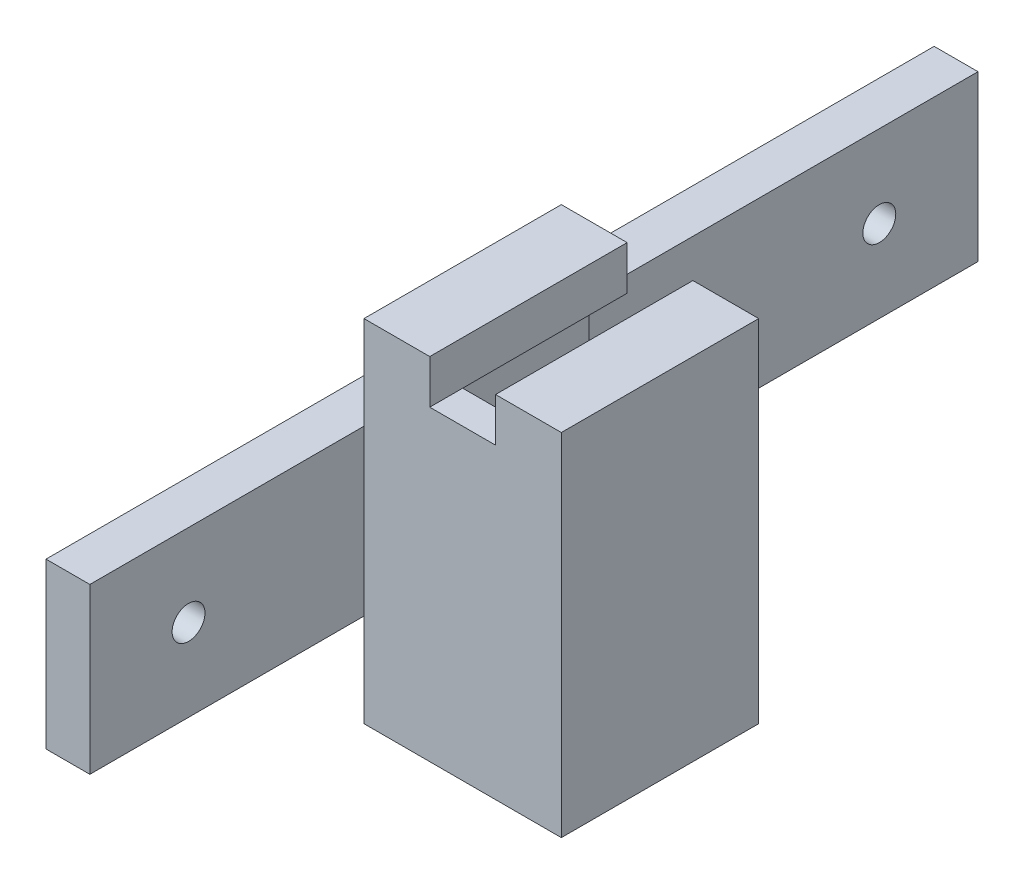
ISO-10303-21;
HEADER;
FILE_DESCRIPTION(('STEP AP214'),'2;1');
FILE_NAME('part.step','',(''),(''),'','','');
FILE_SCHEMA(('AUTOMOTIVE_DESIGN { 1 0 10303 214 1 1 1 1 }'));
ENDSEC;
DATA;
#1=APPLICATION_CONTEXT('core data for automotive mechanical design processes');
#2=APPLICATION_PROTOCOL_DEFINITION('international standard','automotive_design',2000,#1);
#3=PRODUCT_CONTEXT('',#1,'mechanical');
#4=PRODUCT('Part','Part','',(#3));
#5=PRODUCT_RELATED_PRODUCT_CATEGORY('part','',(#4));
#6=PRODUCT_DEFINITION_FORMATION('','',#4);
#7=PRODUCT_DEFINITION_CONTEXT('part definition',#1,'design');
#8=PRODUCT_DEFINITION('design','',#6,#7);
#9=PRODUCT_DEFINITION_SHAPE('','',#8);
#10=(LENGTH_UNIT() NAMED_UNIT(*) SI_UNIT(.MILLI.,.METRE.));
#11=(NAMED_UNIT(*) PLANE_ANGLE_UNIT() SI_UNIT($,.RADIAN.));
#12=(NAMED_UNIT(*) SI_UNIT($,.STERADIAN.) SOLID_ANGLE_UNIT());
#13=UNCERTAINTY_MEASURE_WITH_UNIT(LENGTH_MEASURE(1.E-05),#10,'distance_accuracy_value','');
#14=(GEOMETRIC_REPRESENTATION_CONTEXT(3) GLOBAL_UNCERTAINTY_ASSIGNED_CONTEXT((#13)) GLOBAL_UNIT_ASSIGNED_CONTEXT((#10,
#11,#12)) REPRESENTATION_CONTEXT('',''));
#15=CARTESIAN_POINT('',(0.,0.,0.));
#16=DIRECTION('',(0.,0.,1.));
#17=DIRECTION('',(1.,0.,0.));
#18=AXIS2_PLACEMENT_3D('',#15,#16,#17);
#19=CARTESIAN_POINT('',(-18.,0.,-3.));
#20=DIRECTION('',(1.,0.,0.));
#21=DIRECTION('',(0.,1.,0.));
#22=AXIS2_PLACEMENT_3D('',#19,#20,#21);
#23=PLANE('',#22);
#24=DIRECTION('',(0.,0.,1.));
#25=VECTOR('',#24,1.);
#26=CARTESIAN_POINT('',(-18.,23.5,25.));
#27=LINE('',#26,#25);
#28=CARTESIAN_POINT('',(-18.,23.5,-18.));
#29=VERTEX_POINT('',#28);
#30=CARTESIAN_POINT('',(-18.,23.5,0.));
#31=VERTEX_POINT('',#30);
#32=EDGE_CURVE('E11',#29,#31,#27,.T.);
#33=ORIENTED_EDGE('',*,*,#32,.T.);
#34=DIRECTION('',(0.,-1.,0.));
#35=VECTOR('',#34,1.);
#36=CARTESIAN_POINT('',(-18.,0.,0.));
#37=LINE('',#36,#35);
#38=CARTESIAN_POINT('',(-18.,32.,0.));
#39=VERTEX_POINT('',#38);
#40=EDGE_CURVE('E309',#39,#31,#37,.T.);
#41=ORIENTED_EDGE('',*,*,#40,.F.);
#42=DIRECTION('',(0.,0.,1.));
#43=VECTOR('',#42,1.);
#44=CARTESIAN_POINT('',(-18.,32.,-3.));
#45=LINE('',#44,#43);
#46=CARTESIAN_POINT('',(-18.,32.,-18.));
#47=VERTEX_POINT('',#46);
#48=EDGE_CURVE('E319',#47,#39,#45,.T.);
#49=ORIENTED_EDGE('',*,*,#48,.F.);
#50=DIRECTION('',(0.,-1.,0.));
#51=VECTOR('',#50,1.);
#52=CARTESIAN_POINT('',(-18.,0.,-18.));
#53=LINE('',#52,#51);
#54=EDGE_CURVE('E228',#47,#29,#53,.T.);
#55=ORIENTED_EDGE('',*,*,#54,.T.);
#56=EDGE_LOOP('',(#33,#41,#49,#55));
#57=FACE_BOUND('',#56,.T.);
#58=ADVANCED_FACE('F39',(#57),#23,.F.);
#59=DIRECTION('',(0.,0.,-1.));
#60=VECTOR('',#59,1.);
#61=CARTESIAN_POINT('',(-18.,8.5,25.));
#62=LINE('',#61,#60);
#63=CARTESIAN_POINT('',(-18.,8.5,0.));
#64=VERTEX_POINT('',#63);
#65=CARTESIAN_POINT('',(-18.,8.5,-18.));
#66=VERTEX_POINT('',#65);
#67=EDGE_CURVE('E48',#64,#66,#62,.T.);
#68=ORIENTED_EDGE('',*,*,#67,.T.);
#69=CARTESIAN_POINT('',(-18.,0.,-18.));
#70=VERTEX_POINT('',#69);
#71=EDGE_CURVE('E226',#66,#70,#53,.T.);
#72=ORIENTED_EDGE('',*,*,#71,.T.);
#73=DIRECTION('',(0.,0.,1.));
#74=VECTOR('',#73,1.);
#75=CARTESIAN_POINT('',(-18.,0.,-3.));
#76=LINE('',#75,#74);
#77=CARTESIAN_POINT('',(-18.,0.,0.));
#78=VERTEX_POINT('',#77);
#79=EDGE_CURVE('E316',#70,#78,#76,.T.);
#80=ORIENTED_EDGE('',*,*,#79,.T.);
#81=EDGE_CURVE('E308',#64,#78,#37,.T.);
#82=ORIENTED_EDGE('',*,*,#81,.F.);
#83=EDGE_LOOP('',(#68,#72,#80,#82));
#84=FACE_BOUND('',#83,.T.);
#85=ADVANCED_FACE('F360',(#84),#23,.F.);
#86=CARTESIAN_POINT('',(0.,0.,-3.));
#87=DIRECTION('',(0.,0.,1.));
#88=DIRECTION('',(-1.,0.,0.));
#89=AXIS2_PLACEMENT_3D('',#86,#87,#88);
#90=PLANE('',#89);
#91=DIRECTION('',(1.,0.,0.));
#92=VECTOR('',#91,1.);
#93=CARTESIAN_POINT('',(-15.5,28.,-3.));
#94=LINE('',#93,#92);
#95=CARTESIAN_POINT('',(-15.5,28.,-3.));
#96=VERTEX_POINT('',#95);
#97=CARTESIAN_POINT('',(-12.,28.,-3.));
#98=VERTEX_POINT('',#97);
#99=EDGE_CURVE('E227',#96,#98,#94,.T.);
#100=ORIENTED_EDGE('',*,*,#99,.T.);
#101=DIRECTION('',(-1.,0.,0.));
#102=VECTOR('',#101,1.);
#103=CARTESIAN_POINT('',(-12.,28.,-3.));
#104=LINE('',#103,#102);
#105=CARTESIAN_POINT('',(-6.,28.,-3.));
#106=VERTEX_POINT('',#105);
#107=EDGE_CURVE('E287',#106,#98,#104,.T.);
#108=ORIENTED_EDGE('',*,*,#107,.F.);
#109=DIRECTION('',(1.,0.,0.));
#110=VECTOR('',#109,1.);
#111=CARTESIAN_POINT('',(-6.,28.,-3.));
#112=LINE('',#111,#110);
#113=CARTESIAN_POINT('',(-2.5,28.,-3.));
#114=VERTEX_POINT('',#113);
#115=EDGE_CURVE('E221',#106,#114,#112,.T.);
#116=ORIENTED_EDGE('',*,*,#115,.T.);
#117=DIRECTION('',(0.,-1.,0.));
#118=VECTOR('',#117,1.);
#119=CARTESIAN_POINT('',(-2.5,28.,-3.));
#120=LINE('',#119,#118);
#121=CARTESIAN_POINT('',(-2.5,4.,-3.));
#122=VERTEX_POINT('',#121);
#123=EDGE_CURVE('E263',#114,#122,#120,.T.);
#124=ORIENTED_EDGE('',*,*,#123,.T.);
#125=DIRECTION('',(-1.,0.,0.));
#126=VECTOR('',#125,1.);
#127=CARTESIAN_POINT('',(-2.5,4.,-3.));
#128=LINE('',#127,#126);
#129=CARTESIAN_POINT('',(-15.5,4.,-3.));
#130=VERTEX_POINT('',#129);
#131=EDGE_CURVE('E266',#122,#130,#128,.T.);
#132=ORIENTED_EDGE('',*,*,#131,.T.);
#133=DIRECTION('',(0.,1.,0.));
#134=VECTOR('',#133,1.);
#135=CARTESIAN_POINT('',(-15.5,4.,-3.));
#136=LINE('',#135,#134);
#137=EDGE_CURVE('E269',#130,#96,#136,.T.);
#138=ORIENTED_EDGE('',*,*,#137,.T.);
#139=EDGE_LOOP('',(#100,#108,#116,#124,#132,#138));
#140=FACE_BOUND('',#139,.T.);
#141=ADVANCED_FACE('F393',(#140),#90,.F.);
#142=CARTESIAN_POINT('',(0.,0.,-3.));
#143=DIRECTION('',(-1.,0.,0.));
#144=DIRECTION('',(0.,0.,-1.));
#145=AXIS2_PLACEMENT_3D('',#142,#143,#144);
#146=PLANE('',#145);
#147=DIRECTION('',(0.,1.,0.));
#148=VECTOR('',#147,1.);
#149=CARTESIAN_POINT('',(0.,0.,0.));
#150=LINE('',#149,#148);
#151=CARTESIAN_POINT('',(0.,0.,0.));
#152=VERTEX_POINT('',#151);
#153=CARTESIAN_POINT('',(0.,32.,0.));
#154=VERTEX_POINT('',#153);
#155=EDGE_CURVE('E286',#152,#154,#150,.T.);
#156=ORIENTED_EDGE('',*,*,#155,.F.);
#157=DIRECTION('',(0.,0.,1.));
#158=VECTOR('',#157,1.);
#159=CARTESIAN_POINT('',(0.,0.,-3.));
#160=LINE('',#159,#158);
#161=CARTESIAN_POINT('',(0.,0.,-18.));
#162=VERTEX_POINT('',#161);
#163=EDGE_CURVE('E290',#162,#152,#160,.T.);
#164=ORIENTED_EDGE('',*,*,#163,.F.);
#165=DIRECTION('',(0.,1.,0.));
#166=VECTOR('',#165,1.);
#167=CARTESIAN_POINT('',(0.,32.,-18.));
#168=LINE('',#167,#166);
#169=CARTESIAN_POINT('',(0.,32.,-18.));
#170=VERTEX_POINT('',#169);
#171=EDGE_CURVE('E234',#162,#170,#168,.T.);
#172=ORIENTED_EDGE('',*,*,#171,.T.);
#173=DIRECTION('',(0.,0.,1.));
#174=VECTOR('',#173,1.);
#175=CARTESIAN_POINT('',(0.,32.,-3.));
#176=LINE('',#175,#174);
#177=EDGE_CURVE('E43',#170,#154,#176,.T.);
#178=ORIENTED_EDGE('',*,*,#177,.T.);
#179=EDGE_LOOP('',(#156,#164,#172,#178));
#180=FACE_BOUND('',#179,.T.);
#181=ADVANCED_FACE('F41',(#180),#146,.F.);
#182=CARTESIAN_POINT('',(-6.,32.,-3.));
#183=DIRECTION('',(0.,-1.,0.));
#184=DIRECTION('',(1.,0.,0.));
#185=AXIS2_PLACEMENT_3D('',#182,#183,#184);
#186=PLANE('',#185);
#187=DIRECTION('',(-1.,0.,0.));
#188=VECTOR('',#187,1.);
#189=CARTESIAN_POINT('',(-6.,32.,0.));
#190=LINE('',#189,#188);
#191=CARTESIAN_POINT('',(-6.,32.,0.));
#192=VERTEX_POINT('',#191);
#193=EDGE_CURVE('E294',#154,#192,#190,.T.);
#194=ORIENTED_EDGE('',*,*,#193,.F.);
#195=ORIENTED_EDGE('',*,*,#177,.F.);
#196=DIRECTION('',(-1.,0.,0.));
#197=VECTOR('',#196,1.);
#198=CARTESIAN_POINT('',(-6.,32.,-18.));
#199=LINE('',#198,#197);
#200=CARTESIAN_POINT('',(-6.,32.,-18.));
#201=VERTEX_POINT('',#200);
#202=EDGE_CURVE('E237',#170,#201,#199,.T.);
#203=ORIENTED_EDGE('',*,*,#202,.T.);
#204=DIRECTION('',(0.,0.,1.));
#205=VECTOR('',#204,1.);
#206=CARTESIAN_POINT('',(-6.,32.,-3.));
#207=LINE('',#206,#205);
#208=EDGE_CURVE('E330',#201,#192,#207,.T.);
#209=ORIENTED_EDGE('',*,*,#208,.T.);
#210=EDGE_LOOP('',(#194,#195,#203,#209));
#211=FACE_BOUND('',#210,.T.);
#212=ADVANCED_FACE('F411',(#211),#186,.F.);
#213=CARTESIAN_POINT('',(-6.,28.,-3.));
#214=DIRECTION('',(1.,0.,0.));
#215=DIRECTION('',(0.,1.,0.));
#216=AXIS2_PLACEMENT_3D('',#213,#214,#215);
#217=PLANE('',#216);
#218=DIRECTION('',(0.,-1.,0.));
#219=VECTOR('',#218,1.);
#220=CARTESIAN_POINT('',(-6.,28.,0.));
#221=LINE('',#220,#219);
#222=CARTESIAN_POINT('',(-6.,28.,0.));
#223=VERTEX_POINT('',#222);
#224=EDGE_CURVE('E297',#192,#223,#221,.T.);
#225=ORIENTED_EDGE('',*,*,#224,.F.);
#226=ORIENTED_EDGE('',*,*,#208,.F.);
#227=DIRECTION('',(0.,-1.,0.));
#228=VECTOR('',#227,1.);
#229=CARTESIAN_POINT('',(-6.,28.,-18.));
#230=LINE('',#229,#228);
#231=CARTESIAN_POINT('',(-6.,28.,-18.));
#232=VERTEX_POINT('',#231);
#233=EDGE_CURVE('E240',#201,#232,#230,.T.);
#234=ORIENTED_EDGE('',*,*,#233,.T.);
#235=DIRECTION('',(0.,0.,1.));
#236=VECTOR('',#235,1.);
#237=CARTESIAN_POINT('',(-6.,28.,-18.));
#238=LINE('',#237,#236);
#239=EDGE_CURVE('E283',#232,#106,#238,.T.);
#240=ORIENTED_EDGE('',*,*,#239,.T.);
#241=DIRECTION('',(0.,0.,1.));
#242=VECTOR('',#241,1.);
#243=CARTESIAN_POINT('',(-6.,28.,-3.));
#244=LINE('',#243,#242);
#245=EDGE_CURVE('E328',#106,#223,#244,.T.);
#246=ORIENTED_EDGE('',*,*,#245,.T.);
#247=EDGE_LOOP('',(#225,#226,#234,#240,#246));
#248=FACE_BOUND('',#247,.T.);
#249=ADVANCED_FACE('F408',(#248),#217,.F.);
#250=CARTESIAN_POINT('',(-12.,28.,-3.));
#251=DIRECTION('',(0.,-1.,0.));
#252=DIRECTION('',(0.,0.,1.));
#253=AXIS2_PLACEMENT_3D('',#250,#251,#252);
#254=PLANE('',#253);
#255=DIRECTION('',(-1.,0.,0.));
#256=VECTOR('',#255,1.);
#257=CARTESIAN_POINT('',(-12.,28.,0.));
#258=LINE('',#257,#256);
#259=CARTESIAN_POINT('',(-12.,28.,0.));
#260=VERTEX_POINT('',#259);
#261=EDGE_CURVE('E300',#223,#260,#258,.T.);
#262=ORIENTED_EDGE('',*,*,#261,.F.);
#263=ORIENTED_EDGE('',*,*,#245,.F.);
#264=ORIENTED_EDGE('',*,*,#107,.T.);
#265=DIRECTION('',(0.,0.,1.));
#266=VECTOR('',#265,1.);
#267=CARTESIAN_POINT('',(-12.,28.,-3.));
#268=LINE('',#267,#266);
#269=EDGE_CURVE('E325',#98,#260,#268,.T.);
#270=ORIENTED_EDGE('',*,*,#269,.T.);
#271=EDGE_LOOP('',(#262,#263,#264,#270));
#272=FACE_BOUND('',#271,.T.);
#273=ADVANCED_FACE('F404',(#272),#254,.F.);
#274=CARTESIAN_POINT('',(-12.,32.,-3.));
#275=DIRECTION('',(-1.,0.,0.));
#276=DIRECTION('',(0.,0.,-1.));
#277=AXIS2_PLACEMENT_3D('',#274,#275,#276);
#278=PLANE('',#277);
#279=DIRECTION('',(0.,1.,0.));
#280=VECTOR('',#279,1.);
#281=CARTESIAN_POINT('',(-12.,32.,0.));
#282=LINE('',#281,#280);
#283=CARTESIAN_POINT('',(-12.,32.,0.));
#284=VERTEX_POINT('',#283);
#285=EDGE_CURVE('E303',#260,#284,#282,.T.);
#286=ORIENTED_EDGE('',*,*,#285,.F.);
#287=ORIENTED_EDGE('',*,*,#269,.F.);
#288=DIRECTION('',(0.,0.,1.));
#289=VECTOR('',#288,1.);
#290=CARTESIAN_POINT('',(-12.,28.,-18.));
#291=LINE('',#290,#289);
#292=CARTESIAN_POINT('',(-12.,28.,-18.));
#293=VERTEX_POINT('',#292);
#294=EDGE_CURVE('E260',#293,#98,#291,.T.);
#295=ORIENTED_EDGE('',*,*,#294,.F.);
#296=DIRECTION('',(0.,1.,0.));
#297=VECTOR('',#296,1.);
#298=CARTESIAN_POINT('',(-12.,32.,-18.));
#299=LINE('',#298,#297);
#300=CARTESIAN_POINT('',(-12.,32.,-18.));
#301=VERTEX_POINT('',#300);
#302=EDGE_CURVE('E257',#293,#301,#299,.T.);
#303=ORIENTED_EDGE('',*,*,#302,.T.);
#304=DIRECTION('',(0.,0.,1.));
#305=VECTOR('',#304,1.);
#306=CARTESIAN_POINT('',(-12.,32.,-3.));
#307=LINE('',#306,#305);
#308=EDGE_CURVE('E322',#301,#284,#307,.T.);
#309=ORIENTED_EDGE('',*,*,#308,.T.);
#310=EDGE_LOOP('',(#286,#287,#295,#303,#309));
#311=FACE_BOUND('',#310,.T.);
#312=ADVANCED_FACE('F400',(#311),#278,.F.);
#313=CARTESIAN_POINT('',(-12.,32.,-3.));
#314=DIRECTION('',(0.,-1.,0.));
#315=DIRECTION('',(0.,0.,1.));
#316=AXIS2_PLACEMENT_3D('',#313,#314,#315);
#317=PLANE('',#316);
#318=DIRECTION('',(-1.,0.,0.));
#319=VECTOR('',#318,1.);
#320=CARTESIAN_POINT('',(-12.,32.,0.));
#321=LINE('',#320,#319);
#322=EDGE_CURVE('E306',#284,#39,#321,.T.);
#323=ORIENTED_EDGE('',*,*,#322,.F.);
#324=ORIENTED_EDGE('',*,*,#308,.F.);
#325=DIRECTION('',(-1.,0.,0.));
#326=VECTOR('',#325,1.);
#327=CARTESIAN_POINT('',(-18.,32.,-18.));
#328=LINE('',#327,#326);
#329=EDGE_CURVE('E224',#301,#47,#328,.T.);
#330=ORIENTED_EDGE('',*,*,#329,.T.);
#331=ORIENTED_EDGE('',*,*,#48,.T.);
#332=EDGE_LOOP('',(#323,#324,#330,#331));
#333=FACE_BOUND('',#332,.T.);
#334=ADVANCED_FACE('F397',(#333),#317,.F.);
#335=CARTESIAN_POINT('',(0.,0.,-3.));
#336=DIRECTION('',(0.,1.,0.));
#337=DIRECTION('',(-1.,0.,0.));
#338=AXIS2_PLACEMENT_3D('',#335,#336,#337);
#339=PLANE('',#338);
#340=DIRECTION('',(1.,0.,0.));
#341=VECTOR('',#340,1.);
#342=CARTESIAN_POINT('',(0.,0.,0.));
#343=LINE('',#342,#341);
#344=EDGE_CURVE('E291',#78,#152,#343,.T.);
#345=ORIENTED_EDGE('',*,*,#344,.F.);
#346=ORIENTED_EDGE('',*,*,#79,.F.);
#347=DIRECTION('',(1.,0.,0.));
#348=VECTOR('',#347,1.);
#349=CARTESIAN_POINT('',(-18.,0.,-18.));
#350=LINE('',#349,#348);
#351=EDGE_CURVE('E231',#70,#162,#350,.T.);
#352=ORIENTED_EDGE('',*,*,#351,.T.);
#353=ORIENTED_EDGE('',*,*,#163,.T.);
#354=EDGE_LOOP('',(#345,#346,#352,#353));
#355=FACE_BOUND('',#354,.T.);
#356=ADVANCED_FACE('F364',(#355),#339,.F.);
#357=CARTESIAN_POINT('',(0.,0.,0.));
#358=DIRECTION('',(0.,0.,1.));
#359=DIRECTION('',(-1.,0.,0.));
#360=AXIS2_PLACEMENT_3D('',#357,#358,#359);
#361=PLANE('',#360);
#362=ORIENTED_EDGE('',*,*,#155,.T.);
#363=ORIENTED_EDGE('',*,*,#193,.T.);
#364=ORIENTED_EDGE('',*,*,#224,.T.);
#365=ORIENTED_EDGE('',*,*,#261,.T.);
#366=ORIENTED_EDGE('',*,*,#285,.T.);
#367=ORIENTED_EDGE('',*,*,#322,.T.);
#368=ORIENTED_EDGE('',*,*,#40,.T.);
#369=EDGE_CURVE('E312',#31,#64,#37,.T.);
#370=ORIENTED_EDGE('',*,*,#369,.T.);
#371=ORIENTED_EDGE('',*,*,#81,.T.);
#372=ORIENTED_EDGE('',*,*,#344,.T.);
#373=EDGE_LOOP('',(#362,#363,#364,#365,#366,#367,#368,#370,#371,#372));
#374=FACE_BOUND('',#373,.T.);
#375=ADVANCED_FACE('F368',(#374),#361,.T.);
#376=CARTESIAN_POINT('',(-6.,28.,-18.));
#377=DIRECTION('',(0.,1.,0.));
#378=DIRECTION('',(0.,0.,-1.));
#379=AXIS2_PLACEMENT_3D('',#376,#377,#378);
#380=PLANE('',#379);
#381=ORIENTED_EDGE('',*,*,#115,.F.);
#382=ORIENTED_EDGE('',*,*,#239,.F.);
#383=DIRECTION('',(1.,0.,0.));
#384=VECTOR('',#383,1.);
#385=CARTESIAN_POINT('',(-6.,28.,-18.));
#386=LINE('',#385,#384);
#387=CARTESIAN_POINT('',(-2.5,28.,-18.));
#388=VERTEX_POINT('',#387);
#389=EDGE_CURVE('E243',#232,#388,#386,.T.);
#390=ORIENTED_EDGE('',*,*,#389,.T.);
#391=DIRECTION('',(0.,0.,1.));
#392=VECTOR('',#391,1.);
#393=CARTESIAN_POINT('',(-2.5,28.,-18.));
#394=LINE('',#393,#392);
#395=EDGE_CURVE('E281',#388,#114,#394,.T.);
#396=ORIENTED_EDGE('',*,*,#395,.T.);
#397=EDGE_LOOP('',(#381,#382,#390,#396));
#398=FACE_BOUND('',#397,.T.);
#399=ADVANCED_FACE('F439',(#398),#380,.F.);
#400=CARTESIAN_POINT('',(-2.5,28.,-18.));
#401=DIRECTION('',(1.,0.,0.));
#402=DIRECTION('',(0.,1.,0.));
#403=AXIS2_PLACEMENT_3D('',#400,#401,#402);
#404=PLANE('',#403);
#405=ORIENTED_EDGE('',*,*,#123,.F.);
#406=ORIENTED_EDGE('',*,*,#395,.F.);
#407=DIRECTION('',(0.,-1.,0.));
#408=VECTOR('',#407,1.);
#409=CARTESIAN_POINT('',(-2.5,28.,-18.));
#410=LINE('',#409,#408);
#411=CARTESIAN_POINT('',(-2.5,4.,-18.));
#412=VERTEX_POINT('',#411);
#413=EDGE_CURVE('E246',#388,#412,#410,.T.);
#414=ORIENTED_EDGE('',*,*,#413,.T.);
#415=DIRECTION('',(0.,0.,1.));
#416=VECTOR('',#415,1.);
#417=CARTESIAN_POINT('',(-2.5,4.,-18.));
#418=LINE('',#417,#416);
#419=EDGE_CURVE('E279',#412,#122,#418,.T.);
#420=ORIENTED_EDGE('',*,*,#419,.T.);
#421=EDGE_LOOP('',(#405,#406,#414,#420));
#422=FACE_BOUND('',#421,.T.);
#423=ADVANCED_FACE('F437',(#422),#404,.F.);
#424=CARTESIAN_POINT('',(-2.5,4.,-18.));
#425=DIRECTION('',(0.,-1.,0.));
#426=DIRECTION('',(1.,0.,0.));
#427=AXIS2_PLACEMENT_3D('',#424,#425,#426);
#428=PLANE('',#427);
#429=ORIENTED_EDGE('',*,*,#131,.F.);
#430=ORIENTED_EDGE('',*,*,#419,.F.);
#431=DIRECTION('',(-1.,0.,0.));
#432=VECTOR('',#431,1.);
#433=CARTESIAN_POINT('',(-2.5,4.,-18.));
#434=LINE('',#433,#432);
#435=CARTESIAN_POINT('',(-15.5,4.,-18.));
#436=VERTEX_POINT('',#435);
#437=EDGE_CURVE('E249',#412,#436,#434,.T.);
#438=ORIENTED_EDGE('',*,*,#437,.T.);
#439=DIRECTION('',(0.,0.,1.));
#440=VECTOR('',#439,1.);
#441=CARTESIAN_POINT('',(-15.5,4.,-18.));
#442=LINE('',#441,#440);
#443=EDGE_CURVE('E277',#436,#130,#442,.T.);
#444=ORIENTED_EDGE('',*,*,#443,.T.);
#445=EDGE_LOOP('',(#429,#430,#438,#444));
#446=FACE_BOUND('',#445,.T.);
#447=ADVANCED_FACE('F433',(#446),#428,.F.);
#448=CARTESIAN_POINT('',(-15.5,4.,-18.));
#449=DIRECTION('',(-1.,0.,0.));
#450=DIRECTION('',(0.,-1.,0.));
#451=AXIS2_PLACEMENT_3D('',#448,#449,#450);
#452=PLANE('',#451);
#453=ORIENTED_EDGE('',*,*,#137,.F.);
#454=ORIENTED_EDGE('',*,*,#443,.F.);
#455=DIRECTION('',(0.,1.,0.));
#456=VECTOR('',#455,1.);
#457=CARTESIAN_POINT('',(-15.5,4.,-18.));
#458=LINE('',#457,#456);
#459=CARTESIAN_POINT('',(-15.5,28.,-18.));
#460=VERTEX_POINT('',#459);
#461=EDGE_CURVE('E252',#436,#460,#458,.T.);
#462=ORIENTED_EDGE('',*,*,#461,.T.);
#463=DIRECTION('',(0.,0.,1.));
#464=VECTOR('',#463,1.);
#465=CARTESIAN_POINT('',(-15.5,28.,-18.));
#466=LINE('',#465,#464);
#467=EDGE_CURVE('E275',#460,#96,#466,.T.);
#468=ORIENTED_EDGE('',*,*,#467,.T.);
#469=EDGE_LOOP('',(#453,#454,#462,#468));
#470=FACE_BOUND('',#469,.T.);
#471=ADVANCED_FACE('F429',(#470),#452,.F.);
#472=CARTESIAN_POINT('',(-15.5,28.,-18.));
#473=DIRECTION('',(0.,1.,0.));
#474=DIRECTION('',(0.,0.,-1.));
#475=AXIS2_PLACEMENT_3D('',#472,#473,#474);
#476=PLANE('',#475);
#477=ORIENTED_EDGE('',*,*,#99,.F.);
#478=ORIENTED_EDGE('',*,*,#467,.F.);
#479=DIRECTION('',(1.,0.,0.));
#480=VECTOR('',#479,1.);
#481=CARTESIAN_POINT('',(-15.5,28.,-18.));
#482=LINE('',#481,#480);
#483=EDGE_CURVE('E255',#460,#293,#482,.T.);
#484=ORIENTED_EDGE('',*,*,#483,.T.);
#485=ORIENTED_EDGE('',*,*,#294,.T.);
#486=EDGE_LOOP('',(#477,#478,#484,#485));
#487=FACE_BOUND('',#486,.T.);
#488=ADVANCED_FACE('F426',(#487),#476,.F.);
#489=CARTESIAN_POINT('',(0.,0.,-18.));
#490=DIRECTION('',(0.,0.,1.));
#491=DIRECTION('',(-1.,0.,0.));
#492=AXIS2_PLACEMENT_3D('',#489,#490,#491);
#493=PLANE('',#492);
#494=CARTESIAN_POINT('',(-9.,2.1,-18.));
#495=DIRECTION('',(0.,0.,1.));
#496=DIRECTION('',(1.,0.,0.));
#497=AXIS2_PLACEMENT_3D('',#494,#495,#496);
#498=CIRCLE('',#497,1.05);
#499=CARTESIAN_POINT('',(-7.95,2.1,-18.));
#500=VERTEX_POINT('',#499);
#501=EDGE_CURVE('E193',#500,#500,#498,.T.);
#502=ORIENTED_EDGE('',*,*,#501,.T.);
#503=EDGE_LOOP('',(#502));
#504=FACE_BOUND('',#503,.T.);
#505=ORIENTED_EDGE('',*,*,#329,.F.);
#506=ORIENTED_EDGE('',*,*,#302,.F.);
#507=ORIENTED_EDGE('',*,*,#483,.F.);
#508=ORIENTED_EDGE('',*,*,#461,.F.);
#509=ORIENTED_EDGE('',*,*,#437,.F.);
#510=ORIENTED_EDGE('',*,*,#413,.F.);
#511=ORIENTED_EDGE('',*,*,#389,.F.);
#512=ORIENTED_EDGE('',*,*,#233,.F.);
#513=ORIENTED_EDGE('',*,*,#202,.F.);
#514=ORIENTED_EDGE('',*,*,#171,.F.);
#515=ORIENTED_EDGE('',*,*,#351,.F.);
#516=ORIENTED_EDGE('',*,*,#71,.F.);
#517=EDGE_CURVE('E232',#29,#66,#53,.T.);
#518=ORIENTED_EDGE('',*,*,#517,.F.);
#519=ORIENTED_EDGE('',*,*,#54,.F.);
#520=EDGE_LOOP('',(#505,#506,#507,#508,#509,#510,#511,#512,#513,#514,#515,#516,#518,#519));
#521=FACE_BOUND('',#520,.T.);
#522=ADVANCED_FACE('F357',(#504,#521),#493,.F.);
#523=CARTESIAN_POINT('',(-9.,2.1,-12.));
#524=DIRECTION('',(0.,0.,-1.));
#525=DIRECTION('',(1.,0.,0.));
#526=AXIS2_PLACEMENT_3D('',#523,#524,#525);
#527=CYLINDRICAL_SURFACE('',#526,1.05);
#528=CARTESIAN_POINT('',(-9.,2.1,-12.));
#529=DIRECTION('',(0.,0.,1.));
#530=DIRECTION('',(1.,0.,0.));
#531=AXIS2_PLACEMENT_3D('',#528,#529,#530);
#532=CIRCLE('',#531,1.05);
#533=CARTESIAN_POINT('',(-7.95,2.1,-12.));
#534=VERTEX_POINT('',#533);
#535=EDGE_CURVE('E218',#534,#534,#532,.T.);
#536=ORIENTED_EDGE('',*,*,#535,.T.);
#537=EDGE_LOOP('',(#536));
#538=FACE_BOUND('',#537,.T.);
#539=ORIENTED_EDGE('',*,*,#501,.F.);
#540=EDGE_LOOP('',(#539));
#541=FACE_BOUND('',#540,.T.);
#542=ADVANCED_FACE('F379',(#538,#541),#527,.F.);
#543=CARTESIAN_POINT('',(-9.,2.1,-12.));
#544=DIRECTION('',(0.,0.,-1.));
#545=DIRECTION('',(1.,0.,0.));
#546=AXIS2_PLACEMENT_3D('',#543,#544,#545);
#547=PLANE('',#546);
#548=ORIENTED_EDGE('',*,*,#535,.F.);
#549=EDGE_LOOP('',(#548));
#550=FACE_BOUND('',#549,.T.);
#551=ADVANCED_FACE('F371',(#550),#547,.T.);
#552=CARTESIAN_POINT('',(-18.,0.,0.));
#553=DIRECTION('',(-1.,0.,0.));
#554=DIRECTION('',(0.,-1.,0.));
#555=AXIS2_PLACEMENT_3D('',#552,#553,#554);
#556=PLANE('',#555);
#557=CARTESIAN_POINT('',(-18.,16.,16.));
#558=DIRECTION('',(1.,0.,0.));
#559=DIRECTION('',(0.,-1.,0.));
#560=AXIS2_PLACEMENT_3D('',#557,#558,#559);
#561=CIRCLE('',#560,1.5);
#562=CARTESIAN_POINT('',(-18.,14.5,16.));
#563=VERTEX_POINT('',#562);
#564=EDGE_CURVE('E209',#563,#563,#561,.T.);
#565=ORIENTED_EDGE('',*,*,#564,.F.);
#566=EDGE_LOOP('',(#565));
#567=FACE_BOUND('',#566,.T.);
#568=CARTESIAN_POINT('',(-18.,23.5,25.));
#569=VERTEX_POINT('',#568);
#570=EDGE_CURVE('E51',#31,#569,#27,.T.);
#571=ORIENTED_EDGE('',*,*,#570,.T.);
#572=DIRECTION('',(0.,-1.,0.));
#573=VECTOR('',#572,1.);
#574=CARTESIAN_POINT('',(-18.,23.5,25.));
#575=LINE('',#574,#573);
#576=CARTESIAN_POINT('',(-18.,8.5,25.));
#577=VERTEX_POINT('',#576);
#578=EDGE_CURVE('E206',#569,#577,#575,.T.);
#579=ORIENTED_EDGE('',*,*,#578,.T.);
#580=EDGE_CURVE('E65',#577,#64,#62,.T.);
#581=ORIENTED_EDGE('',*,*,#580,.T.);
#582=ORIENTED_EDGE('',*,*,#369,.F.);
#583=EDGE_LOOP('',(#571,#579,#581,#582));
#584=FACE_BOUND('',#583,.T.);
#585=ADVANCED_FACE('F369',(#567,#584),#556,.F.);
#586=CARTESIAN_POINT('',(-22.,23.5,25.));
#587=DIRECTION('',(0.,0.,-1.));
#588=DIRECTION('',(1.,0.,0.));
#589=AXIS2_PLACEMENT_3D('',#586,#587,#588);
#590=PLANE('',#589);
#591=ORIENTED_EDGE('',*,*,#578,.F.);
#592=DIRECTION('',(1.,0.,0.));
#593=VECTOR('',#592,1.);
#594=CARTESIAN_POINT('',(-22.,23.5,25.));
#595=LINE('',#594,#593);
#596=CARTESIAN_POINT('',(-22.,23.5,25.));
#597=VERTEX_POINT('',#596);
#598=EDGE_CURVE('E197',#597,#569,#595,.T.);
#599=ORIENTED_EDGE('',*,*,#598,.F.);
#600=DIRECTION('',(0.,-1.,0.));
#601=VECTOR('',#600,1.);
#602=CARTESIAN_POINT('',(-22.,23.5,25.));
#603=LINE('',#602,#601);
#604=CARTESIAN_POINT('',(-22.,8.5,25.));
#605=VERTEX_POINT('',#604);
#606=EDGE_CURVE('E180',#597,#605,#603,.T.);
#607=ORIENTED_EDGE('',*,*,#606,.T.);
#608=DIRECTION('',(1.,0.,0.));
#609=VECTOR('',#608,1.);
#610=CARTESIAN_POINT('',(-22.,8.5,25.));
#611=LINE('',#610,#609);
#612=EDGE_CURVE('E188',#605,#577,#611,.T.);
#613=ORIENTED_EDGE('',*,*,#612,.T.);
#614=EDGE_LOOP('',(#591,#599,#607,#613));
#615=FACE_BOUND('',#614,.T.);
#616=ADVANCED_FACE('F196',(#615),#590,.F.);
#617=CARTESIAN_POINT('',(-22.,8.5,25.));
#618=DIRECTION('',(0.,1.,0.));
#619=DIRECTION('',(-1.,0.,0.));
#620=AXIS2_PLACEMENT_3D('',#617,#618,#619);
#621=PLANE('',#620);
#622=ORIENTED_EDGE('',*,*,#580,.F.);
#623=ORIENTED_EDGE('',*,*,#612,.F.);
#624=DIRECTION('',(0.,0.,-1.));
#625=VECTOR('',#624,1.);
#626=CARTESIAN_POINT('',(-22.,8.5,25.));
#627=LINE('',#626,#625);
#628=CARTESIAN_POINT('',(-22.,8.5,-56.));
#629=VERTEX_POINT('',#628);
#630=EDGE_CURVE('E176',#605,#629,#627,.T.);
#631=ORIENTED_EDGE('',*,*,#630,.T.);
#632=DIRECTION('',(1.,0.,0.));
#633=VECTOR('',#632,1.);
#634=CARTESIAN_POINT('',(-22.,8.5,-56.));
#635=LINE('',#634,#633);
#636=CARTESIAN_POINT('',(-18.,8.5,-56.));
#637=VERTEX_POINT('',#636);
#638=EDGE_CURVE('E194',#629,#637,#635,.T.);
#639=ORIENTED_EDGE('',*,*,#638,.T.);
#640=EDGE_CURVE('E208',#66,#637,#62,.T.);
#641=ORIENTED_EDGE('',*,*,#640,.F.);
#642=ORIENTED_EDGE('',*,*,#67,.F.);
#643=EDGE_LOOP('',(#622,#623,#631,#639,#641,#642));
#644=FACE_BOUND('',#643,.T.);
#645=ADVANCED_FACE('F189',(#644),#621,.F.);
#646=CARTESIAN_POINT('',(-22.,23.5,-56.));
#647=DIRECTION('',(0.,0.,1.));
#648=DIRECTION('',(-1.,0.,0.));
#649=AXIS2_PLACEMENT_3D('',#646,#647,#648);
#650=PLANE('',#649);
#651=DIRECTION('',(0.,1.,0.));
#652=VECTOR('',#651,1.);
#653=CARTESIAN_POINT('',(-18.,23.5,-56.));
#654=LINE('',#653,#652);
#655=CARTESIAN_POINT('',(-18.,23.5,-56.));
#656=VERTEX_POINT('',#655);
#657=EDGE_CURVE('E211',#637,#656,#654,.T.);
#658=ORIENTED_EDGE('',*,*,#657,.F.);
#659=ORIENTED_EDGE('',*,*,#638,.F.);
#660=DIRECTION('',(0.,1.,0.));
#661=VECTOR('',#660,1.);
#662=CARTESIAN_POINT('',(-22.,23.5,-56.));
#663=LINE('',#662,#661);
#664=CARTESIAN_POINT('',(-22.,23.5,-56.));
#665=VERTEX_POINT('',#664);
#666=EDGE_CURVE('E183',#629,#665,#663,.T.);
#667=ORIENTED_EDGE('',*,*,#666,.T.);
#668=DIRECTION('',(1.,0.,0.));
#669=VECTOR('',#668,1.);
#670=CARTESIAN_POINT('',(-22.,23.5,-56.));
#671=LINE('',#670,#669);
#672=EDGE_CURVE('E214',#665,#656,#671,.T.);
#673=ORIENTED_EDGE('',*,*,#672,.T.);
#674=EDGE_LOOP('',(#658,#659,#667,#673));
#675=FACE_BOUND('',#674,.T.);
#676=ADVANCED_FACE('F346',(#675),#650,.F.);
#677=CARTESIAN_POINT('',(-22.,23.5,25.));
#678=DIRECTION('',(0.,-1.,0.));
#679=DIRECTION('',(1.,0.,0.));
#680=AXIS2_PLACEMENT_3D('',#677,#678,#679);
#681=PLANE('',#680);
#682=EDGE_CURVE('E50',#656,#29,#27,.T.);
#683=ORIENTED_EDGE('',*,*,#682,.F.);
#684=ORIENTED_EDGE('',*,*,#672,.F.);
#685=DIRECTION('',(0.,0.,1.));
#686=VECTOR('',#685,1.);
#687=CARTESIAN_POINT('',(-22.,23.5,25.));
#688=LINE('',#687,#686);
#689=EDGE_CURVE('E204',#665,#597,#688,.T.);
#690=ORIENTED_EDGE('',*,*,#689,.T.);
#691=ORIENTED_EDGE('',*,*,#598,.T.);
#692=ORIENTED_EDGE('',*,*,#570,.F.);
#693=ORIENTED_EDGE('',*,*,#32,.F.);
#694=EDGE_LOOP('',(#683,#684,#690,#691,#692,#693));
#695=FACE_BOUND('',#694,.T.);
#696=ADVANCED_FACE('F349',(#695),#681,.F.);
#697=CARTESIAN_POINT('',(-22.,0.,0.));
#698=DIRECTION('',(-1.,0.,0.));
#699=DIRECTION('',(0.,-1.,0.));
#700=AXIS2_PLACEMENT_3D('',#697,#698,#699);
#701=PLANE('',#700);
#702=CARTESIAN_POINT('',(-22.,16.,16.));
#703=DIRECTION('',(1.,0.,0.));
#704=DIRECTION('',(0.,-1.,0.));
#705=AXIS2_PLACEMENT_3D('',#702,#703,#704);
#706=CIRCLE('',#705,1.5);
#707=CARTESIAN_POINT('',(-22.,14.5,16.));
#708=VERTEX_POINT('',#707);
#709=EDGE_CURVE('E715',#708,#708,#706,.T.);
#710=ORIENTED_EDGE('',*,*,#709,.T.);
#711=EDGE_LOOP('',(#710));
#712=FACE_BOUND('',#711,.T.);
#713=CARTESIAN_POINT('',(-22.,16.,-47.));
#714=DIRECTION('',(1.,0.,0.));
#715=DIRECTION('',(0.,-1.,0.));
#716=AXIS2_PLACEMENT_3D('',#713,#714,#715);
#717=CIRCLE('',#716,1.5);
#718=CARTESIAN_POINT('',(-22.,14.5,-47.));
#719=VERTEX_POINT('',#718);
#720=EDGE_CURVE('E716',#719,#719,#717,.T.);
#721=ORIENTED_EDGE('',*,*,#720,.T.);
#722=EDGE_LOOP('',(#721));
#723=FACE_BOUND('',#722,.T.);
#724=ORIENTED_EDGE('',*,*,#606,.F.);
#725=ORIENTED_EDGE('',*,*,#689,.F.);
#726=ORIENTED_EDGE('',*,*,#666,.F.);
#727=ORIENTED_EDGE('',*,*,#630,.F.);
#728=EDGE_LOOP('',(#724,#725,#726,#727));
#729=FACE_BOUND('',#728,.T.);
#730=ADVANCED_FACE('F178',(#712,#723,#729),#701,.T.);
#731=CARTESIAN_POINT('',(-18.,16.,-47.));
#732=DIRECTION('',(1.,0.,0.));
#733=DIRECTION('',(0.,-1.,0.));
#734=AXIS2_PLACEMENT_3D('',#731,#732,#733);
#735=CIRCLE('',#734,1.5);
#736=CARTESIAN_POINT('',(-18.,14.5,-47.));
#737=VERTEX_POINT('',#736);
#738=EDGE_CURVE('E200',#737,#737,#735,.T.);
#739=ORIENTED_EDGE('',*,*,#738,.F.);
#740=EDGE_LOOP('',(#739));
#741=FACE_BOUND('',#740,.T.);
#742=ORIENTED_EDGE('',*,*,#517,.T.);
#743=ORIENTED_EDGE('',*,*,#640,.T.);
#744=ORIENTED_EDGE('',*,*,#657,.T.);
#745=ORIENTED_EDGE('',*,*,#682,.T.);
#746=EDGE_LOOP('',(#742,#743,#744,#745));
#747=FACE_BOUND('',#746,.T.);
#748=ADVANCED_FACE('F343',(#741,#747),#556,.F.);
#749=CARTESIAN_POINT('',(-18.,16.,-47.));
#750=DIRECTION('',(-1.,0.,0.));
#751=DIRECTION('',(0.,-1.,0.));
#752=AXIS2_PLACEMENT_3D('',#749,#750,#751);
#753=CYLINDRICAL_SURFACE('',#752,1.5);
#754=ORIENTED_EDGE('',*,*,#738,.T.);
#755=EDGE_LOOP('',(#754));
#756=FACE_BOUND('',#755,.T.);
#757=ORIENTED_EDGE('',*,*,#720,.F.);
#758=EDGE_LOOP('',(#757));
#759=FACE_BOUND('',#758,.T.);
#760=ADVANCED_FACE('F386',(#756,#759),#753,.F.);
#761=CARTESIAN_POINT('',(-18.,16.,16.));
#762=DIRECTION('',(-1.,0.,0.));
#763=DIRECTION('',(0.,-1.,0.));
#764=AXIS2_PLACEMENT_3D('',#761,#762,#763);
#765=CYLINDRICAL_SURFACE('',#764,1.5);
#766=ORIENTED_EDGE('',*,*,#564,.T.);
#767=EDGE_LOOP('',(#766));
#768=FACE_BOUND('',#767,.T.);
#769=ORIENTED_EDGE('',*,*,#709,.F.);
#770=EDGE_LOOP('',(#769));
#771=FACE_BOUND('',#770,.T.);
#772=ADVANCED_FACE('F669',(#768,#771),#765,.F.);
#773=CLOSED_SHELL('',(#58,#85,#141,#181,#212,#249,#273,#312,#334,#356,#375,#399,#423,#447,#471,
#488,#522,#542,#551,#585,#616,#645,#676,#696,#730,#748,#760,#772));
#774=MANIFOLD_SOLID_BREP('B2',#773);
#775=ADVANCED_BREP_SHAPE_REPRESENTATION('',(#18,#774),#14);
#776=SHAPE_DEFINITION_REPRESENTATION(#9,#775);
ENDSEC;
END-ISO-10303-21;
